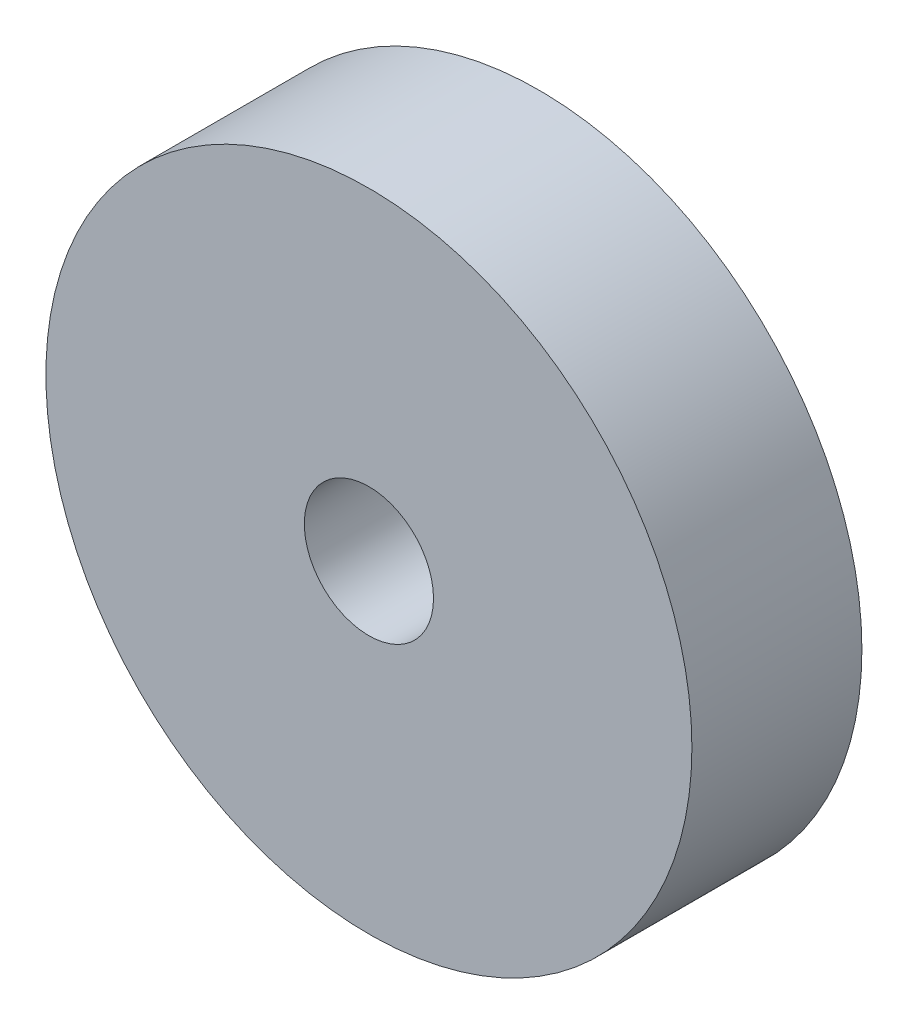
ISO-10303-21;
HEADER;
FILE_DESCRIPTION(('STEP AP214'),'2;1');
FILE_NAME('part.step','',(''),(''),'','','');
FILE_SCHEMA(('AUTOMOTIVE_DESIGN { 1 0 10303 214 1 1 1 1 }'));
ENDSEC;
DATA;
#1=APPLICATION_CONTEXT('core data for automotive mechanical design processes');
#2=APPLICATION_PROTOCOL_DEFINITION('international standard','automotive_design',2000,#1);
#3=PRODUCT_CONTEXT('',#1,'mechanical');
#4=PRODUCT('Part','Part','',(#3));
#5=PRODUCT_RELATED_PRODUCT_CATEGORY('part','',(#4));
#6=PRODUCT_DEFINITION_FORMATION('','',#4);
#7=PRODUCT_DEFINITION_CONTEXT('part definition',#1,'design');
#8=PRODUCT_DEFINITION('design','',#6,#7);
#9=PRODUCT_DEFINITION_SHAPE('','',#8);
#10=(LENGTH_UNIT() NAMED_UNIT(*) SI_UNIT(.MILLI.,.METRE.));
#11=(NAMED_UNIT(*) PLANE_ANGLE_UNIT() SI_UNIT($,.RADIAN.));
#12=(NAMED_UNIT(*) SI_UNIT($,.STERADIAN.) SOLID_ANGLE_UNIT());
#13=UNCERTAINTY_MEASURE_WITH_UNIT(LENGTH_MEASURE(1.E-05),#10,'distance_accuracy_value','');
#14=(GEOMETRIC_REPRESENTATION_CONTEXT(3) GLOBAL_UNCERTAINTY_ASSIGNED_CONTEXT((#13)) GLOBAL_UNIT_ASSIGNED_CONTEXT((#10,
#11,#12)) REPRESENTATION_CONTEXT('',''));
#15=CARTESIAN_POINT('',(0.,0.,0.));
#16=DIRECTION('',(0.,0.,1.));
#17=DIRECTION('',(1.,0.,0.));
#18=AXIS2_PLACEMENT_3D('',#15,#16,#17);
#19=CARTESIAN_POINT('',(0.,0.,50.));
#20=DIRECTION('',(0.,0.,1.));
#21=DIRECTION('',(1.,0.,0.));
#22=AXIS2_PLACEMENT_3D('',#19,#20,#21);
#23=PLANE('',#22);
#24=CARTESIAN_POINT('',(0.,0.,50.));
#25=DIRECTION('',(0.,0.,1.));
#26=DIRECTION('',(1.,0.,0.));
#27=AXIS2_PLACEMENT_3D('',#24,#25,#26);
#28=CIRCLE('',#27,95.);
#29=CARTESIAN_POINT('',(95.,0.,50.));
#30=VERTEX_POINT('',#29);
#31=EDGE_CURVE('E10',#30,#30,#28,.T.);
#32=ORIENTED_EDGE('',*,*,#31,.T.);
#33=EDGE_LOOP('',(#32));
#34=FACE_BOUND('',#33,.T.);
#35=CARTESIAN_POINT('',(0.,0.,50.));
#36=DIRECTION('',(0.,0.,1.));
#37=DIRECTION('',(1.,0.,0.));
#38=AXIS2_PLACEMENT_3D('',#35,#36,#37);
#39=CIRCLE('',#38,19.);
#40=CARTESIAN_POINT('',(19.,0.,50.));
#41=VERTEX_POINT('',#40);
#42=EDGE_CURVE('E42',#41,#41,#39,.T.);
#43=ORIENTED_EDGE('',*,*,#42,.F.);
#44=EDGE_LOOP('',(#43));
#45=FACE_BOUND('',#44,.T.);
#46=ADVANCED_FACE('F31',(#34,#45),#23,.T.);
#47=CARTESIAN_POINT('',(0.,0.,0.));
#48=DIRECTION('',(0.,0.,1.));
#49=DIRECTION('',(1.,0.,0.));
#50=AXIS2_PLACEMENT_3D('',#47,#48,#49);
#51=PLANE('',#50);
#52=CARTESIAN_POINT('',(0.,0.,0.));
#53=DIRECTION('',(0.,0.,1.));
#54=DIRECTION('',(1.,0.,0.));
#55=AXIS2_PLACEMENT_3D('',#52,#53,#54);
#56=CIRCLE('',#55,95.);
#57=CARTESIAN_POINT('',(95.,0.,0.));
#58=VERTEX_POINT('',#57);
#59=EDGE_CURVE('E35',#58,#58,#56,.T.);
#60=ORIENTED_EDGE('',*,*,#59,.F.);
#61=EDGE_LOOP('',(#60));
#62=FACE_BOUND('',#61,.T.);
#63=CARTESIAN_POINT('',(0.,0.,0.));
#64=DIRECTION('',(0.,0.,1.));
#65=DIRECTION('',(1.,0.,0.));
#66=AXIS2_PLACEMENT_3D('',#63,#64,#65);
#67=CIRCLE('',#66,19.);
#68=CARTESIAN_POINT('',(19.,0.,0.));
#69=VERTEX_POINT('',#68);
#70=EDGE_CURVE('E44',#69,#69,#67,.T.);
#71=ORIENTED_EDGE('',*,*,#70,.T.);
#72=EDGE_LOOP('',(#71));
#73=FACE_BOUND('',#72,.T.);
#74=ADVANCED_FACE('F54',(#62,#73),#51,.F.);
#75=CARTESIAN_POINT('',(0.,0.,50.));
#76=DIRECTION('',(0.,0.,-1.));
#77=DIRECTION('',(-1.,0.,0.));
#78=AXIS2_PLACEMENT_3D('',#75,#76,#77);
#79=CYLINDRICAL_SURFACE('',#78,95.);
#80=ORIENTED_EDGE('',*,*,#31,.F.);
#81=EDGE_LOOP('',(#80));
#82=FACE_BOUND('',#81,.T.);
#83=ORIENTED_EDGE('',*,*,#59,.T.);
#84=EDGE_LOOP('',(#83));
#85=FACE_BOUND('',#84,.T.);
#86=ADVANCED_FACE('F33',(#82,#85),#79,.T.);
#87=CARTESIAN_POINT('',(0.,0.,50.));
#88=DIRECTION('',(0.,0.,-1.));
#89=DIRECTION('',(-1.,0.,0.));
#90=AXIS2_PLACEMENT_3D('',#87,#88,#89);
#91=CYLINDRICAL_SURFACE('',#90,19.);
#92=ORIENTED_EDGE('',*,*,#42,.T.);
#93=EDGE_LOOP('',(#92));
#94=FACE_BOUND('',#93,.T.);
#95=ORIENTED_EDGE('',*,*,#70,.F.);
#96=EDGE_LOOP('',(#95));
#97=FACE_BOUND('',#96,.T.);
#98=ADVANCED_FACE('F50',(#94,#97),#91,.F.);
#99=CLOSED_SHELL('',(#46,#74,#86,#98));
#100=MANIFOLD_SOLID_BREP('B2',#99);
#101=ADVANCED_BREP_SHAPE_REPRESENTATION('',(#18,#100),#14);
#102=SHAPE_DEFINITION_REPRESENTATION(#9,#101);
ENDSEC;
END-ISO-10303-21;
